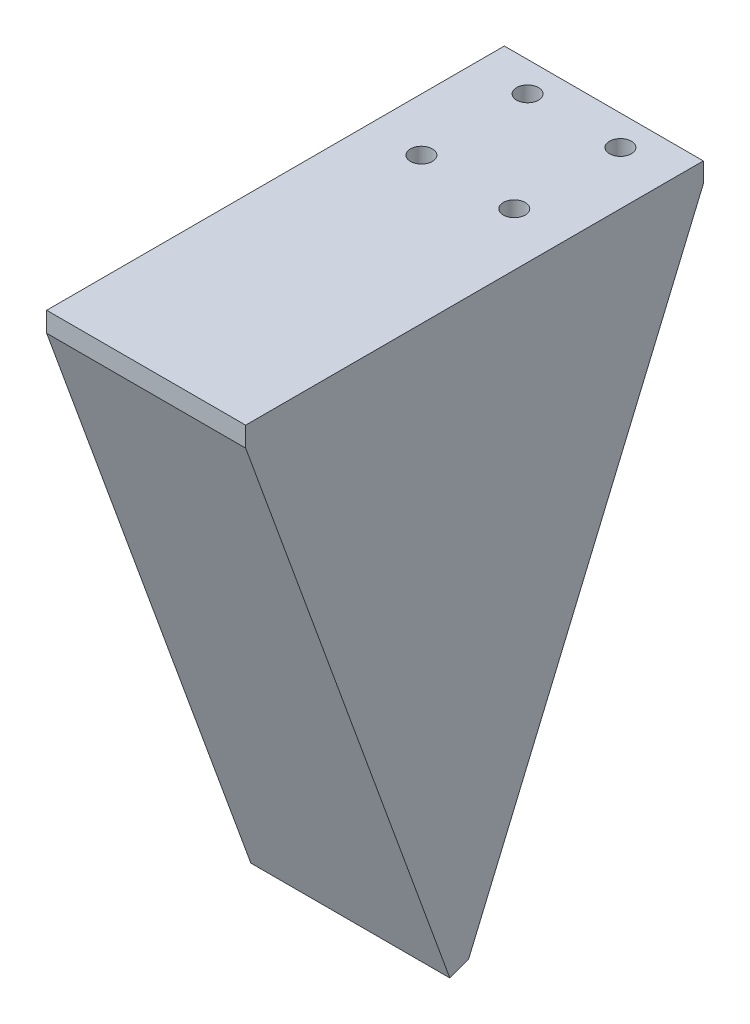
ISO-10303-21;
HEADER;
FILE_DESCRIPTION(('STEP AP214'),'2;1');
FILE_NAME('part.step','',(''),(''),'','','');
FILE_SCHEMA(('AUTOMOTIVE_DESIGN { 1 0 10303 214 1 1 1 1 }'));
ENDSEC;
DATA;
#1=APPLICATION_CONTEXT('core data for automotive mechanical design processes');
#2=APPLICATION_PROTOCOL_DEFINITION('international standard','automotive_design',2000,#1);
#3=PRODUCT_CONTEXT('',#1,'mechanical');
#4=PRODUCT('Part','Part','',(#3));
#5=PRODUCT_RELATED_PRODUCT_CATEGORY('part','',(#4));
#6=PRODUCT_DEFINITION_FORMATION('','',#4);
#7=PRODUCT_DEFINITION_CONTEXT('part definition',#1,'design');
#8=PRODUCT_DEFINITION('design','',#6,#7);
#9=PRODUCT_DEFINITION_SHAPE('','',#8);
#10=(LENGTH_UNIT() NAMED_UNIT(*) SI_UNIT(.MILLI.,.METRE.));
#11=(NAMED_UNIT(*) PLANE_ANGLE_UNIT() SI_UNIT($,.RADIAN.));
#12=(NAMED_UNIT(*) SI_UNIT($,.STERADIAN.) SOLID_ANGLE_UNIT());
#13=UNCERTAINTY_MEASURE_WITH_UNIT(LENGTH_MEASURE(1.E-05),#10,'distance_accuracy_value','');
#14=(GEOMETRIC_REPRESENTATION_CONTEXT(3) GLOBAL_UNCERTAINTY_ASSIGNED_CONTEXT((#13)) GLOBAL_UNIT_ASSIGNED_CONTEXT((#10,
#11,#12)) REPRESENTATION_CONTEXT('',''));
#15=CARTESIAN_POINT('',(0.,0.,0.));
#16=DIRECTION('',(0.,0.,1.));
#17=DIRECTION('',(1.,0.,0.));
#18=AXIS2_PLACEMENT_3D('',#15,#16,#17);
#19=CARTESIAN_POINT('',(0.,0.,0.));
#20=DIRECTION('',(0.,1.,0.));
#21=DIRECTION('',(0.,0.,1.));
#22=AXIS2_PLACEMENT_3D('',#19,#20,#21);
#23=PLANE('',#22);
#24=CARTESIAN_POINT('',(-7.,0.,-9.49999999999998));
#25=DIRECTION('',(0.,1.,0.));
#26=DIRECTION('',(0.,0.,1.));
#27=AXIS2_PLACEMENT_3D('',#24,#25,#26);
#28=CIRCLE('',#27,1.65);
#29=CARTESIAN_POINT('',(-7.,0.,-7.84999999999998));
#30=VERTEX_POINT('',#29);
#31=EDGE_CURVE('E178',#30,#30,#28,.T.);
#32=ORIENTED_EDGE('',*,*,#31,.T.);
#33=EDGE_LOOP('',(#32));
#34=FACE_BOUND('',#33,.T.);
#35=CARTESIAN_POINT('',(7.,0.,-25.5));
#36=DIRECTION('',(0.,1.,0.));
#37=DIRECTION('',(0.,0.,1.));
#38=AXIS2_PLACEMENT_3D('',#35,#36,#37);
#39=CIRCLE('',#38,1.65);
#40=CARTESIAN_POINT('',(7.,0.,-23.85));
#41=VERTEX_POINT('',#40);
#42=EDGE_CURVE('E205',#41,#41,#39,.T.);
#43=ORIENTED_EDGE('',*,*,#42,.T.);
#44=EDGE_LOOP('',(#43));
#45=FACE_BOUND('',#44,.T.);
#46=CARTESIAN_POINT('',(-7.,0.,-25.5));
#47=DIRECTION('',(0.,1.,0.));
#48=DIRECTION('',(0.,0.,1.));
#49=AXIS2_PLACEMENT_3D('',#46,#47,#48);
#50=CIRCLE('',#49,1.65);
#51=CARTESIAN_POINT('',(-7.,0.,-23.85));
#52=VERTEX_POINT('',#51);
#53=EDGE_CURVE('E209',#52,#52,#50,.T.);
#54=ORIENTED_EDGE('',*,*,#53,.T.);
#55=EDGE_LOOP('',(#54));
#56=FACE_BOUND('',#55,.T.);
#57=CARTESIAN_POINT('',(7.,0.,-9.49999999999998));
#58=DIRECTION('',(0.,1.,0.));
#59=DIRECTION('',(0.,0.,1.));
#60=AXIS2_PLACEMENT_3D('',#57,#58,#59);
#61=CIRCLE('',#60,1.65);
#62=CARTESIAN_POINT('',(7.,0.,-7.84999999999998));
#63=VERTEX_POINT('',#62);
#64=EDGE_CURVE('E193',#63,#63,#61,.T.);
#65=ORIENTED_EDGE('',*,*,#64,.T.);
#66=EDGE_LOOP('',(#65));
#67=FACE_BOUND('',#66,.T.);
#68=DIRECTION('',(0.,0.,-1.));
#69=VECTOR('',#68,1.);
#70=CARTESIAN_POINT('',(12.,0.,0.));
#71=LINE('',#70,#69);
#72=CARTESIAN_POINT('',(12.,0.,35.8074666825723));
#73=VERTEX_POINT('',#72);
#74=CARTESIAN_POINT('',(12.,0.,-30.));
#75=VERTEX_POINT('',#74);
#76=EDGE_CURVE('E133',#73,#75,#71,.T.);
#77=ORIENTED_EDGE('',*,*,#76,.F.);
#78=DIRECTION('',(-1.,0.,0.));
#79=VECTOR('',#78,1.);
#80=CARTESIAN_POINT('',(106.002746412454,0.,35.8074666825723));
#81=LINE('',#80,#79);
#82=CARTESIAN_POINT('',(-15.,0.,35.8074666825723));
#83=VERTEX_POINT('',#82);
#84=EDGE_CURVE('E55',#73,#83,#81,.T.);
#85=ORIENTED_EDGE('',*,*,#84,.T.);
#86=DIRECTION('',(0.,0.,1.));
#87=VECTOR('',#86,1.);
#88=CARTESIAN_POINT('',(-15.,0.,28.));
#89=LINE('',#88,#87);
#90=CARTESIAN_POINT('',(-15.,0.,-30.));
#91=VERTEX_POINT('',#90);
#92=EDGE_CURVE('E189',#91,#83,#89,.T.);
#93=ORIENTED_EDGE('',*,*,#92,.F.);
#94=DIRECTION('',(-1.,0.,0.));
#95=VECTOR('',#94,1.);
#96=CARTESIAN_POINT('',(15.,0.,-30.));
#97=LINE('',#96,#95);
#98=EDGE_CURVE('E74',#75,#91,#97,.T.);
#99=ORIENTED_EDGE('',*,*,#98,.F.);
#100=EDGE_LOOP('',(#77,#85,#93,#99));
#101=FACE_BOUND('',#100,.T.);
#102=ADVANCED_FACE('F39',(#34,#45,#56,#67,#101),#23,.F.);
#103=CARTESIAN_POINT('',(106.002746412454,-83.5462754407546,5.39910923833175));
#104=DIRECTION('',(0.,0.342020143325673,-0.939692620785907));
#105=DIRECTION('',(0.,0.939692620785907,0.342020143325673));
#106=AXIS2_PLACEMENT_3D('',#103,#104,#105);
#107=PLANE('',#106);
#108=ORIENTED_EDGE('',*,*,#84,.F.);
#109=DIRECTION('',(0.,-0.939692620785907,-0.342020143325673));
#110=VECTOR('',#109,1.);
#111=CARTESIAN_POINT('',(12.,-83.5462754407546,5.39910923833175));
#112=LINE('',#111,#110);
#113=CARTESIAN_POINT('',(12.,-83.5462754407546,5.39910923833175));
#114=VERTEX_POINT('',#113);
#115=EDGE_CURVE('E11',#73,#114,#112,.T.);
#116=ORIENTED_EDGE('',*,*,#115,.T.);
#117=DIRECTION('',(-1.,0.,0.));
#118=VECTOR('',#117,1.);
#119=CARTESIAN_POINT('',(106.002746412454,-83.5462754407546,5.39910923833175));
#120=LINE('',#119,#118);
#121=CARTESIAN_POINT('',(-15.,-83.5462754407546,5.39910923833175));
#122=VERTEX_POINT('',#121);
#123=EDGE_CURVE('E129',#114,#122,#120,.T.);
#124=ORIENTED_EDGE('',*,*,#123,.T.);
#125=DIRECTION('',(0.,-0.939692620785907,-0.342020143325673));
#126=VECTOR('',#125,1.);
#127=CARTESIAN_POINT('',(-15.,-83.5462754407546,5.39910923833175));
#128=LINE('',#127,#126);
#129=EDGE_CURVE('E277',#83,#122,#128,.T.);
#130=ORIENTED_EDGE('',*,*,#129,.F.);
#131=EDGE_LOOP('',(#108,#116,#124,#130));
#132=FACE_BOUND('',#131,.T.);
#133=ADVANCED_FACE('F137',(#132),#107,.T.);
#134=CARTESIAN_POINT('',(-15.,3.,28.));
#135=DIRECTION('',(1.,0.,0.));
#136=DIRECTION('',(0.,0.,-1.));
#137=AXIS2_PLACEMENT_3D('',#134,#135,#136);
#138=PLANE('',#137);
#139=ORIENTED_EDGE('',*,*,#92,.T.);
#140=ORIENTED_EDGE('',*,*,#129,.T.);
#141=DIRECTION('',(0.,-0.342020143325674,0.939692620785907));
#142=VECTOR('',#141,1.);
#143=CARTESIAN_POINT('',(-15.,-84.5723358707316,8.21818710068947));
#144=LINE('',#143,#142);
#145=CARTESIAN_POINT('',(-15.,-84.5723358707316,8.21818710068947));
#146=VERTEX_POINT('',#145);
#147=EDGE_CURVE('E141',#122,#146,#144,.T.);
#148=ORIENTED_EDGE('',*,*,#147,.T.);
#149=DIRECTION('',(0.,0.939692620785907,0.342020143325673));
#150=VECTOR('',#149,1.);
#151=CARTESIAN_POINT('',(-15.,0.,39.));
#152=LINE('',#151,#150);
#153=CARTESIAN_POINT('',(-15.,0.,39.));
#154=VERTEX_POINT('',#153);
#155=EDGE_CURVE('E145',#146,#154,#152,.T.);
#156=ORIENTED_EDGE('',*,*,#155,.T.);
#157=DIRECTION('',(0.,-1.,0.));
#158=VECTOR('',#157,1.);
#159=CARTESIAN_POINT('',(-15.,3.,39.));
#160=LINE('',#159,#158);
#161=CARTESIAN_POINT('',(-15.,3.,39.));
#162=VERTEX_POINT('',#161);
#163=EDGE_CURVE('E150',#162,#154,#160,.T.);
#164=ORIENTED_EDGE('',*,*,#163,.F.);
#165=DIRECTION('',(0.,0.,1.));
#166=VECTOR('',#165,1.);
#167=CARTESIAN_POINT('',(-15.,3.,28.));
#168=LINE('',#167,#166);
#169=CARTESIAN_POINT('',(-15.,3.,-30.));
#170=VERTEX_POINT('',#169);
#171=EDGE_CURVE('E179',#170,#162,#168,.T.);
#172=ORIENTED_EDGE('',*,*,#171,.F.);
#173=DIRECTION('',(0.,-1.,0.));
#174=VECTOR('',#173,1.);
#175=CARTESIAN_POINT('',(-15.,3.,-30.));
#176=LINE('',#175,#174);
#177=EDGE_CURVE('E188',#170,#91,#176,.T.);
#178=ORIENTED_EDGE('',*,*,#177,.T.);
#179=EDGE_LOOP('',(#139,#140,#148,#156,#164,#172,#178));
#180=FACE_BOUND('',#179,.T.);
#181=ADVANCED_FACE('F41',(#180),#138,.F.);
#182=CARTESIAN_POINT('',(15.,3.,28.));
#183=DIRECTION('',(-1.,0.,0.));
#184=DIRECTION('',(0.,0.,1.));
#185=AXIS2_PLACEMENT_3D('',#182,#183,#184);
#186=PLANE('',#185);
#187=DIRECTION('',(0.,0.920759064294808,-0.390131702786314));
#188=VECTOR('',#187,1.);
#189=CARTESIAN_POINT('',(15.,0.,-30.));
#190=LINE('',#189,#188);
#191=CARTESIAN_POINT('',(15.,-83.5462754407546,5.39910923833175));
#192=VERTEX_POINT('',#191);
#193=CARTESIAN_POINT('',(15.,0.,-30.));
#194=VERTEX_POINT('',#193);
#195=EDGE_CURVE('E122',#192,#194,#190,.T.);
#196=ORIENTED_EDGE('',*,*,#195,.T.);
#197=DIRECTION('',(0.,-1.,0.));
#198=VECTOR('',#197,1.);
#199=CARTESIAN_POINT('',(15.,3.,-30.));
#200=LINE('',#199,#198);
#201=CARTESIAN_POINT('',(15.,3.,-30.));
#202=VERTEX_POINT('',#201);
#203=EDGE_CURVE('E48',#202,#194,#200,.T.);
#204=ORIENTED_EDGE('',*,*,#203,.F.);
#205=DIRECTION('',(0.,0.,-1.));
#206=VECTOR('',#205,1.);
#207=CARTESIAN_POINT('',(15.,3.,28.));
#208=LINE('',#207,#206);
#209=CARTESIAN_POINT('',(15.,3.,39.));
#210=VERTEX_POINT('',#209);
#211=EDGE_CURVE('E182',#210,#202,#208,.T.);
#212=ORIENTED_EDGE('',*,*,#211,.F.);
#213=DIRECTION('',(0.,1.,0.));
#214=VECTOR('',#213,1.);
#215=CARTESIAN_POINT('',(15.,0.,39.));
#216=LINE('',#215,#214);
#217=CARTESIAN_POINT('',(15.,0.,39.));
#218=VERTEX_POINT('',#217);
#219=EDGE_CURVE('E157',#218,#210,#216,.T.);
#220=ORIENTED_EDGE('',*,*,#219,.F.);
#221=DIRECTION('',(0.,-0.939692620785907,-0.342020143325673));
#222=VECTOR('',#221,1.);
#223=CARTESIAN_POINT('',(15.,0.,39.));
#224=LINE('',#223,#222);
#225=CARTESIAN_POINT('',(15.,-84.5723358707316,8.21818710068947));
#226=VERTEX_POINT('',#225);
#227=EDGE_CURVE('E154',#218,#226,#224,.T.);
#228=ORIENTED_EDGE('',*,*,#227,.T.);
#229=DIRECTION('',(0.,0.342020143325674,-0.939692620785907));
#230=VECTOR('',#229,1.);
#231=CARTESIAN_POINT('',(15.,-84.5723358707316,8.21818710068947));
#232=LINE('',#231,#230);
#233=EDGE_CURVE('E259',#226,#192,#232,.T.);
#234=ORIENTED_EDGE('',*,*,#233,.T.);
#235=EDGE_LOOP('',(#196,#204,#212,#220,#228,#234));
#236=FACE_BOUND('',#235,.T.);
#237=ADVANCED_FACE('F249',(#236),#186,.F.);
#238=CARTESIAN_POINT('',(15.,3.,-30.));
#239=DIRECTION('',(0.,0.,1.));
#240=DIRECTION('',(1.,0.,0.));
#241=AXIS2_PLACEMENT_3D('',#238,#239,#240);
#242=PLANE('',#241);
#243=EDGE_CURVE('E183',#194,#75,#97,.T.);
#244=ORIENTED_EDGE('',*,*,#243,.T.);
#245=ORIENTED_EDGE('',*,*,#98,.T.);
#246=ORIENTED_EDGE('',*,*,#177,.F.);
#247=DIRECTION('',(-1.,0.,0.));
#248=VECTOR('',#247,1.);
#249=CARTESIAN_POINT('',(15.,3.,-30.));
#250=LINE('',#249,#248);
#251=EDGE_CURVE('E64',#202,#170,#250,.T.);
#252=ORIENTED_EDGE('',*,*,#251,.F.);
#253=ORIENTED_EDGE('',*,*,#203,.T.);
#254=EDGE_LOOP('',(#244,#245,#246,#252,#253));
#255=FACE_BOUND('',#254,.T.);
#256=ADVANCED_FACE('F247',(#255),#242,.F.);
#257=CARTESIAN_POINT('',(0.,3.,0.));
#258=DIRECTION('',(0.,1.,0.));
#259=DIRECTION('',(0.,0.,1.));
#260=AXIS2_PLACEMENT_3D('',#257,#258,#259);
#261=PLANE('',#260);
#262=ORIENTED_EDGE('',*,*,#251,.T.);
#263=ORIENTED_EDGE('',*,*,#171,.T.);
#264=DIRECTION('',(-1.,0.,0.));
#265=VECTOR('',#264,1.);
#266=CARTESIAN_POINT('',(15.,3.,39.));
#267=LINE('',#266,#265);
#268=EDGE_CURVE('E81',#210,#162,#267,.T.);
#269=ORIENTED_EDGE('',*,*,#268,.F.);
#270=ORIENTED_EDGE('',*,*,#211,.T.);
#271=EDGE_LOOP('',(#262,#263,#269,#270));
#272=FACE_BOUND('',#271,.T.);
#273=CARTESIAN_POINT('',(7.,3.,-9.49999999999998));
#274=DIRECTION('',(0.,1.,0.));
#275=DIRECTION('',(0.,0.,1.));
#276=AXIS2_PLACEMENT_3D('',#273,#274,#275);
#277=CIRCLE('',#276,1.65);
#278=CARTESIAN_POINT('',(7.,3.,-7.84999999999998));
#279=VERTEX_POINT('',#278);
#280=EDGE_CURVE('E167',#279,#279,#277,.T.);
#281=ORIENTED_EDGE('',*,*,#280,.F.);
#282=EDGE_LOOP('',(#281));
#283=FACE_BOUND('',#282,.T.);
#284=CARTESIAN_POINT('',(-7.,3.,-25.5));
#285=DIRECTION('',(0.,1.,0.));
#286=DIRECTION('',(0.,0.,1.));
#287=AXIS2_PLACEMENT_3D('',#284,#285,#286);
#288=CIRCLE('',#287,1.65);
#289=CARTESIAN_POINT('',(-7.,3.,-23.85));
#290=VERTEX_POINT('',#289);
#291=EDGE_CURVE('E166',#290,#290,#288,.T.);
#292=ORIENTED_EDGE('',*,*,#291,.F.);
#293=EDGE_LOOP('',(#292));
#294=FACE_BOUND('',#293,.T.);
#295=CARTESIAN_POINT('',(7.,3.,-25.5));
#296=DIRECTION('',(0.,1.,0.));
#297=DIRECTION('',(0.,0.,1.));
#298=AXIS2_PLACEMENT_3D('',#295,#296,#297);
#299=CIRCLE('',#298,1.65);
#300=CARTESIAN_POINT('',(7.,3.,-23.85));
#301=VERTEX_POINT('',#300);
#302=EDGE_CURVE('E162',#301,#301,#299,.T.);
#303=ORIENTED_EDGE('',*,*,#302,.F.);
#304=EDGE_LOOP('',(#303));
#305=FACE_BOUND('',#304,.T.);
#306=CARTESIAN_POINT('',(-7.,3.,-9.49999999999998));
#307=DIRECTION('',(0.,1.,0.));
#308=DIRECTION('',(0.,0.,1.));
#309=AXIS2_PLACEMENT_3D('',#306,#307,#308);
#310=CIRCLE('',#309,1.65);
#311=CARTESIAN_POINT('',(-7.,3.,-7.84999999999998));
#312=VERTEX_POINT('',#311);
#313=EDGE_CURVE('E171',#312,#312,#310,.T.);
#314=ORIENTED_EDGE('',*,*,#313,.F.);
#315=EDGE_LOOP('',(#314));
#316=FACE_BOUND('',#315,.T.);
#317=ADVANCED_FACE('F245',(#272,#283,#294,#305,#316),#261,.T.);
#318=CARTESIAN_POINT('',(-7.,-1.,-9.49999999999998));
#319=DIRECTION('',(0.,1.,0.));
#320=DIRECTION('',(0.,0.,1.));
#321=AXIS2_PLACEMENT_3D('',#318,#319,#320);
#322=CYLINDRICAL_SURFACE('',#321,1.65);
#323=ORIENTED_EDGE('',*,*,#313,.T.);
#324=EDGE_LOOP('',(#323));
#325=FACE_BOUND('',#324,.T.);
#326=ORIENTED_EDGE('',*,*,#31,.F.);
#327=EDGE_LOOP('',(#326));
#328=FACE_BOUND('',#327,.T.);
#329=ADVANCED_FACE('F294',(#325,#328),#322,.F.);
#330=CARTESIAN_POINT('',(7.,-1.,-25.5));
#331=DIRECTION('',(0.,1.,0.));
#332=DIRECTION('',(0.,0.,1.));
#333=AXIS2_PLACEMENT_3D('',#330,#331,#332);
#334=CYLINDRICAL_SURFACE('',#333,1.65);
#335=ORIENTED_EDGE('',*,*,#302,.T.);
#336=EDGE_LOOP('',(#335));
#337=FACE_BOUND('',#336,.T.);
#338=ORIENTED_EDGE('',*,*,#42,.F.);
#339=EDGE_LOOP('',(#338));
#340=FACE_BOUND('',#339,.T.);
#341=ADVANCED_FACE('F230',(#337,#340),#334,.F.);
#342=CARTESIAN_POINT('',(-7.,-1.,-25.5));
#343=DIRECTION('',(0.,1.,0.));
#344=DIRECTION('',(0.,0.,1.));
#345=AXIS2_PLACEMENT_3D('',#342,#343,#344);
#346=CYLINDRICAL_SURFACE('',#345,1.65);
#347=ORIENTED_EDGE('',*,*,#291,.T.);
#348=EDGE_LOOP('',(#347));
#349=FACE_BOUND('',#348,.T.);
#350=ORIENTED_EDGE('',*,*,#53,.F.);
#351=EDGE_LOOP('',(#350));
#352=FACE_BOUND('',#351,.T.);
#353=ADVANCED_FACE('F220',(#349,#352),#346,.F.);
#354=CARTESIAN_POINT('',(7.,-1.,-9.49999999999998));
#355=DIRECTION('',(0.,1.,0.));
#356=DIRECTION('',(0.,0.,1.));
#357=AXIS2_PLACEMENT_3D('',#354,#355,#356);
#358=CYLINDRICAL_SURFACE('',#357,1.65);
#359=ORIENTED_EDGE('',*,*,#280,.T.);
#360=EDGE_LOOP('',(#359));
#361=FACE_BOUND('',#360,.T.);
#362=ORIENTED_EDGE('',*,*,#64,.F.);
#363=EDGE_LOOP('',(#362));
#364=FACE_BOUND('',#363,.T.);
#365=ADVANCED_FACE('F217',(#361,#364),#358,.F.);
#366=CARTESIAN_POINT('',(0.,0.,39.));
#367=DIRECTION('',(0.,0.,1.));
#368=DIRECTION('',(1.,0.,0.));
#369=AXIS2_PLACEMENT_3D('',#366,#367,#368);
#370=PLANE('',#369);
#371=ORIENTED_EDGE('',*,*,#268,.T.);
#372=ORIENTED_EDGE('',*,*,#163,.T.);
#373=DIRECTION('',(1.,0.,0.));
#374=VECTOR('',#373,1.);
#375=CARTESIAN_POINT('',(-15.,0.,39.));
#376=LINE('',#375,#374);
#377=EDGE_CURVE('E153',#154,#218,#376,.T.);
#378=ORIENTED_EDGE('',*,*,#377,.T.);
#379=ORIENTED_EDGE('',*,*,#219,.T.);
#380=EDGE_LOOP('',(#371,#372,#378,#379));
#381=FACE_BOUND('',#380,.T.);
#382=ADVANCED_FACE('F219',(#381),#370,.T.);
#383=CARTESIAN_POINT('',(106.002746412454,0.,39.));
#384=DIRECTION('',(0.,-0.342020143325673,0.939692620785907));
#385=DIRECTION('',(0.,-0.939692620785907,-0.342020143325673));
#386=AXIS2_PLACEMENT_3D('',#383,#384,#385);
#387=PLANE('',#386);
#388=ORIENTED_EDGE('',*,*,#227,.F.);
#389=ORIENTED_EDGE('',*,*,#377,.F.);
#390=ORIENTED_EDGE('',*,*,#155,.F.);
#391=DIRECTION('',(-1.,0.,0.));
#392=VECTOR('',#391,1.);
#393=CARTESIAN_POINT('',(106.002746412454,-84.5723358707316,8.21818710068947));
#394=LINE('',#393,#392);
#395=EDGE_CURVE('E128',#226,#146,#394,.T.);
#396=ORIENTED_EDGE('',*,*,#395,.F.);
#397=EDGE_LOOP('',(#388,#389,#390,#396));
#398=FACE_BOUND('',#397,.T.);
#399=ADVANCED_FACE('F228',(#398),#387,.T.);
#400=CARTESIAN_POINT('',(106.002746412454,-84.5723358707316,8.21818710068947));
#401=DIRECTION('',(0.,-0.939692620785907,-0.342020143325674));
#402=DIRECTION('',(0.,0.342020143325674,-0.939692620785907));
#403=AXIS2_PLACEMENT_3D('',#400,#401,#402);
#404=PLANE('',#403);
#405=ORIENTED_EDGE('',*,*,#395,.T.);
#406=ORIENTED_EDGE('',*,*,#147,.F.);
#407=ORIENTED_EDGE('',*,*,#123,.F.);
#408=EDGE_CURVE('E117',#192,#114,#120,.T.);
#409=ORIENTED_EDGE('',*,*,#408,.F.);
#410=ORIENTED_EDGE('',*,*,#233,.F.);
#411=EDGE_LOOP('',(#405,#406,#407,#409,#410));
#412=FACE_BOUND('',#411,.T.);
#413=ADVANCED_FACE('F139',(#412),#404,.T.);
#414=CARTESIAN_POINT('',(12.,0.,0.));
#415=DIRECTION('',(1.,0.,0.));
#416=DIRECTION('',(0.,0.,-1.));
#417=AXIS2_PLACEMENT_3D('',#414,#415,#416);
#418=PLANE('',#417);
#419=ORIENTED_EDGE('',*,*,#115,.F.);
#420=ORIENTED_EDGE('',*,*,#76,.T.);
#421=DIRECTION('',(0.,0.920759064294808,-0.390131702786314));
#422=VECTOR('',#421,1.);
#423=CARTESIAN_POINT('',(12.,0.,-30.));
#424=LINE('',#423,#422);
#425=EDGE_CURVE('E120',#114,#75,#424,.T.);
#426=ORIENTED_EDGE('',*,*,#425,.F.);
#427=EDGE_LOOP('',(#419,#420,#426));
#428=FACE_BOUND('',#427,.T.);
#429=ADVANCED_FACE('F132',(#428),#418,.F.);
#430=CARTESIAN_POINT('',(12.,0.,-30.));
#431=DIRECTION('',(0.,-0.390131702786314,-0.920759064294808));
#432=DIRECTION('',(0.,0.920759064294808,-0.390131702786314));
#433=AXIS2_PLACEMENT_3D('',#430,#431,#432);
#434=PLANE('',#433);
#435=ORIENTED_EDGE('',*,*,#195,.F.);
#436=ORIENTED_EDGE('',*,*,#408,.T.);
#437=ORIENTED_EDGE('',*,*,#425,.T.);
#438=ORIENTED_EDGE('',*,*,#243,.F.);
#439=EDGE_LOOP('',(#435,#436,#437,#438));
#440=FACE_BOUND('',#439,.T.);
#441=ADVANCED_FACE('F119',(#440),#434,.T.);
#442=CLOSED_SHELL('',(#102,#133,#181,#237,#256,#317,#329,#341,#353,#365,#382,#399,#413,#429,#441));
#443=MANIFOLD_SOLID_BREP('B2',#442);
#444=ADVANCED_BREP_SHAPE_REPRESENTATION('',(#18,#443),#14);
#445=SHAPE_DEFINITION_REPRESENTATION(#9,#444);
ENDSEC;
END-ISO-10303-21;
